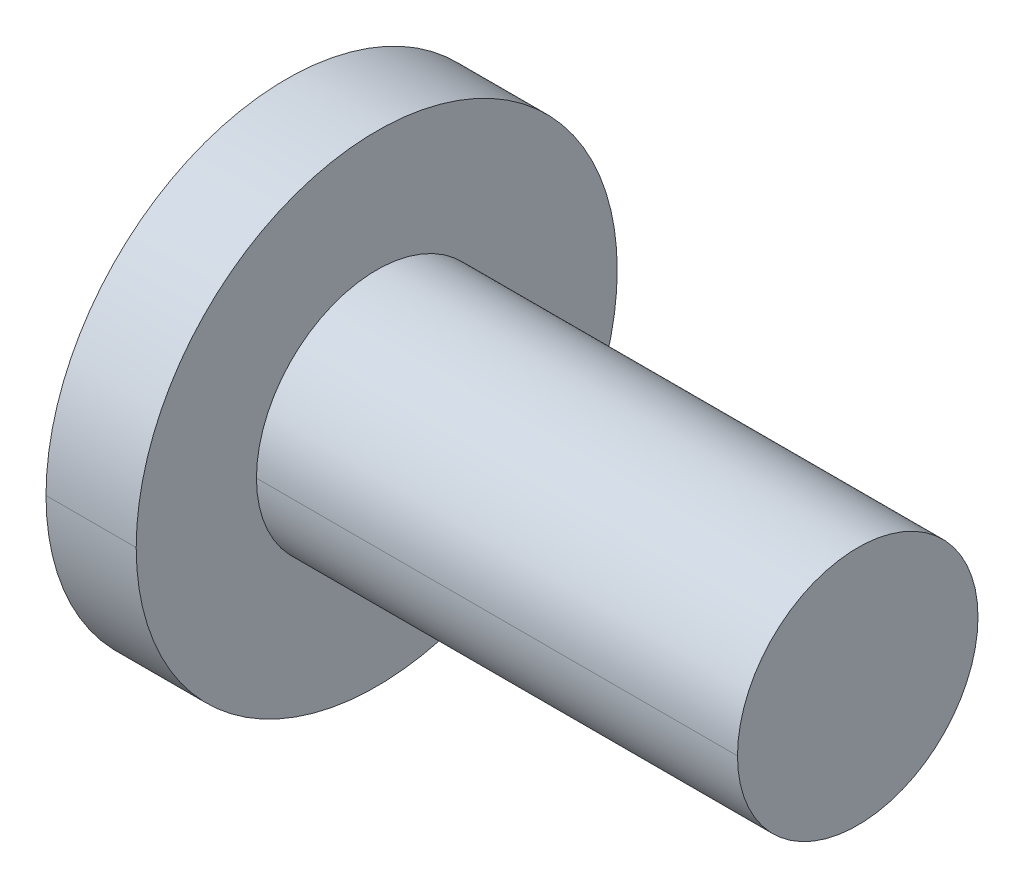
ISO-10303-21;
HEADER;
FILE_DESCRIPTION(('STEP AP214'),'2;1');
FILE_NAME('part.step','',(''),(''),'','','');
FILE_SCHEMA(('AUTOMOTIVE_DESIGN { 1 0 10303 214 1 1 1 1 }'));
ENDSEC;
DATA;
#1=APPLICATION_CONTEXT('core data for automotive mechanical design processes');
#2=APPLICATION_PROTOCOL_DEFINITION('international standard','automotive_design',2000,#1);
#3=PRODUCT_CONTEXT('',#1,'mechanical');
#4=PRODUCT('Part','Part','',(#3));
#5=PRODUCT_RELATED_PRODUCT_CATEGORY('part','',(#4));
#6=PRODUCT_DEFINITION_FORMATION('','',#4);
#7=PRODUCT_DEFINITION_CONTEXT('part definition',#1,'design');
#8=PRODUCT_DEFINITION('design','',#6,#7);
#9=PRODUCT_DEFINITION_SHAPE('','',#8);
#10=(LENGTH_UNIT() NAMED_UNIT(*) SI_UNIT(.MILLI.,.METRE.));
#11=(NAMED_UNIT(*) PLANE_ANGLE_UNIT() SI_UNIT($,.RADIAN.));
#12=(NAMED_UNIT(*) SI_UNIT($,.STERADIAN.) SOLID_ANGLE_UNIT());
#13=UNCERTAINTY_MEASURE_WITH_UNIT(LENGTH_MEASURE(1.E-05),#10,'distance_accuracy_value','');
#14=(GEOMETRIC_REPRESENTATION_CONTEXT(3) GLOBAL_UNCERTAINTY_ASSIGNED_CONTEXT((#13)) GLOBAL_UNIT_ASSIGNED_CONTEXT((#10,
#11,#12)) REPRESENTATION_CONTEXT('',''));
#15=CARTESIAN_POINT('',(0.,0.,0.));
#16=DIRECTION('',(0.,0.,1.));
#17=DIRECTION('',(1.,0.,0.));
#18=AXIS2_PLACEMENT_3D('',#15,#16,#17);
#19=CARTESIAN_POINT('',(-1.5,0.,0.));
#20=DIRECTION('',(1.,0.,0.));
#21=DIRECTION('',(0.,0.,-1.));
#22=AXIS2_PLACEMENT_3D('',#19,#20,#21);
#23=PLANE('',#22);
#24=CARTESIAN_POINT('',(-1.5,0.,0.));
#25=DIRECTION('',(1.,0.,0.));
#26=DIRECTION('',(0.,0.,-1.));
#27=AXIS2_PLACEMENT_3D('',#24,#25,#26);
#28=CIRCLE('',#27,4.);
#29=CARTESIAN_POINT('',(-1.5,0.,4.));
#30=VERTEX_POINT('',#29);
#31=CARTESIAN_POINT('',(-1.5,0.,-4.));
#32=VERTEX_POINT('',#31);
#33=EDGE_CURVE('E46',#30,#32,#28,.T.);
#34=ORIENTED_EDGE('',*,*,#33,.F.);
#35=CARTESIAN_POINT('',(-1.5,0.,0.));
#36=DIRECTION('',(1.,0.,0.));
#37=DIRECTION('',(0.,0.,-1.));
#38=AXIS2_PLACEMENT_3D('',#35,#36,#37);
#39=CIRCLE('',#38,4.);
#40=EDGE_CURVE('E320',#32,#30,#39,.T.);
#41=ORIENTED_EDGE('',*,*,#40,.F.);
#42=EDGE_LOOP('',(#34,#41));
#43=FACE_BOUND('',#42,.T.);
#44=CARTESIAN_POINT('',(-1.5,0.981495457622327,0.566666666666635));
#45=DIRECTION('',(1.,0.,0.));
#46=DIRECTION('',(0.,0.,-1.));
#47=AXIS2_PLACEMENT_3D('',#44,#45,#46);
#48=CIRCLE('',#47,0.200000000000005);
#49=CARTESIAN_POINT('',(-1.5,1.0588012008707,0.38221119219971));
#50=VERTEX_POINT('',#49);
#51=CARTESIAN_POINT('',(-1.5,0.86040520249101,0.7258431414116));
#52=VERTEX_POINT('',#51);
#53=EDGE_CURVE('E310',#50,#52,#48,.T.);
#54=ORIENTED_EDGE('',*,*,#53,.T.);
#55=CARTESIAN_POINT('',(-1.5,0.666666666666669,1.15470053837926));
#56=DIRECTION('',(1.,0.,0.));
#57=DIRECTION('',(0.,0.,-1.));
#58=AXIS2_PLACEMENT_3D('',#55,#56,#57);
#59=CIRCLE('',#58,0.470588235294121);
#60=CARTESIAN_POINT('',(-1.5,0.19839599837964,1.1080543336113));
#61=VERTEX_POINT('',#60);
#62=EDGE_CURVE('E304',#61,#52,#59,.T.);
#63=ORIENTED_EDGE('',*,*,#62,.F.);
#64=CARTESIAN_POINT('',(-1.5,0.,1.1333333333333));
#65=DIRECTION('',(1.,0.,0.));
#66=DIRECTION('',(0.,0.,-1.));
#67=AXIS2_PLACEMENT_3D('',#64,#65,#66);
#68=CIRCLE('',#67,0.2);
#69=CARTESIAN_POINT('',(-1.5,-0.19839599837964,1.1080543336113));
#70=VERTEX_POINT('',#69);
#71=EDGE_CURVE('E302',#61,#70,#68,.T.);
#72=ORIENTED_EDGE('',*,*,#71,.T.);
#73=CARTESIAN_POINT('',(-1.5,-0.666666666666669,1.15470053837926));
#74=DIRECTION('',(1.,0.,0.));
#75=DIRECTION('',(0.,0.,-1.));
#76=AXIS2_PLACEMENT_3D('',#73,#74,#75);
#77=CIRCLE('',#76,0.470588235294122);
#78=CARTESIAN_POINT('',(-1.5,-0.86040520249101,0.7258431414116));
#79=VERTEX_POINT('',#78);
#80=EDGE_CURVE('E291',#79,#70,#77,.T.);
#81=ORIENTED_EDGE('',*,*,#80,.F.);
#82=CARTESIAN_POINT('',(-1.5,-0.981495457622395,0.566666666666697));
#83=DIRECTION('',(1.,0.,0.));
#84=DIRECTION('',(0.,0.,-1.));
#85=AXIS2_PLACEMENT_3D('',#82,#83,#84);
#86=CIRCLE('',#85,0.199999999999997);
#87=CARTESIAN_POINT('',(-1.5,-1.0588012008706,0.38221119219971));
#88=VERTEX_POINT('',#87);
#89=EDGE_CURVE('E286',#79,#88,#86,.T.);
#90=ORIENTED_EDGE('',*,*,#89,.T.);
#91=CARTESIAN_POINT('',(-1.5,-1.33333333333334,0.));
#92=DIRECTION('',(1.,0.,0.));
#93=DIRECTION('',(0.,0.,-1.));
#94=AXIS2_PLACEMENT_3D('',#91,#92,#93);
#95=CIRCLE('',#94,0.470588235294124);
#96=CARTESIAN_POINT('',(-1.5,-1.0588012008707,-0.38221119219971));
#97=VERTEX_POINT('',#96);
#98=EDGE_CURVE('E283',#97,#88,#95,.T.);
#99=ORIENTED_EDGE('',*,*,#98,.F.);
#100=CARTESIAN_POINT('',(-1.5,-0.981495457622394,-0.566666666666674));
#101=DIRECTION('',(1.,0.,0.));
#102=DIRECTION('',(0.,0.,-1.));
#103=AXIS2_PLACEMENT_3D('',#100,#101,#102);
#104=CIRCLE('',#103,0.200000000000014);
#105=CARTESIAN_POINT('',(-1.5,-0.86040520249101,-0.7258431414116));
#106=VERTEX_POINT('',#105);
#107=EDGE_CURVE('E272',#97,#106,#104,.T.);
#108=ORIENTED_EDGE('',*,*,#107,.T.);
#109=CARTESIAN_POINT('',(-1.5,-0.666666666666669,-1.15470053837926));
#110=DIRECTION('',(1.,0.,0.));
#111=DIRECTION('',(0.,0.,-1.));
#112=AXIS2_PLACEMENT_3D('',#109,#110,#111);
#113=CIRCLE('',#112,0.470588235294121);
#114=CARTESIAN_POINT('',(-1.5,-0.19839599837964,-1.1080543336113));
#115=VERTEX_POINT('',#114);
#116=EDGE_CURVE('E266',#115,#106,#113,.T.);
#117=ORIENTED_EDGE('',*,*,#116,.F.);
#118=CARTESIAN_POINT('',(-1.5,0.,-1.1333333333333));
#119=DIRECTION('',(1.,0.,0.));
#120=DIRECTION('',(0.,0.,-1.));
#121=AXIS2_PLACEMENT_3D('',#118,#119,#120);
#122=CIRCLE('',#121,0.2);
#123=CARTESIAN_POINT('',(-1.5,0.19839599837964,-1.1080543336113));
#124=VERTEX_POINT('',#123);
#125=EDGE_CURVE('E264',#115,#124,#122,.T.);
#126=ORIENTED_EDGE('',*,*,#125,.T.);
#127=CARTESIAN_POINT('',(-1.5,0.666666666666664,-1.15470053837924));
#128=DIRECTION('',(1.,0.,0.));
#129=DIRECTION('',(0.,0.,-1.));
#130=AXIS2_PLACEMENT_3D('',#127,#128,#129);
#131=CIRCLE('',#130,0.470588235294114);
#132=CARTESIAN_POINT('',(-1.5,0.86040520249102,-0.7258431414116));
#133=VERTEX_POINT('',#132);
#134=EDGE_CURVE('E263',#133,#124,#131,.T.);
#135=ORIENTED_EDGE('',*,*,#134,.F.);
#136=CARTESIAN_POINT('',(-1.5,0.981495457622399,-0.566666666666696));
#137=DIRECTION('',(1.,0.,0.));
#138=DIRECTION('',(0.,0.,-1.));
#139=AXIS2_PLACEMENT_3D('',#136,#137,#138);
#140=CIRCLE('',#139,0.199999999999994);
#141=CARTESIAN_POINT('',(-1.5,1.0588012008706,-0.382211192199711));
#142=VERTEX_POINT('',#141);
#143=EDGE_CURVE('E247',#133,#142,#140,.T.);
#144=ORIENTED_EDGE('',*,*,#143,.T.);
#145=CARTESIAN_POINT('',(-1.5,1.33333333333334,0.));
#146=DIRECTION('',(-1.,0.,0.));
#147=DIRECTION('',(0.,0.,-1.));
#148=AXIS2_PLACEMENT_3D('',#145,#146,#147);
#149=CIRCLE('',#148,0.470588235294124);
#150=EDGE_CURVE('E243',#142,#50,#149,.T.);
#151=ORIENTED_EDGE('',*,*,#150,.T.);
#152=EDGE_LOOP('',(#54,#63,#72,#81,#90,#99,#108,#117,#126,#135,#144,#151));
#153=FACE_BOUND('',#152,.T.);
#154=ADVANCED_FACE('F39',(#43,#153),#23,.F.);
#155=CARTESIAN_POINT('',(0.,1.33333333333334,0.));
#156=DIRECTION('',(-1.,0.,0.));
#157=DIRECTION('',(0.,1.,-1.30500995355961E-13));
#158=AXIS2_PLACEMENT_3D('',#155,#156,#157);
#159=CYLINDRICAL_SURFACE('',#158,0.470588235294124);
#160=DIRECTION('',(-1.,0.,0.));
#161=VECTOR('',#160,1.);
#162=CARTESIAN_POINT('',(0.,1.0588012008707,0.38221119219971));
#163=LINE('',#162,#161);
#164=CARTESIAN_POINT('',(0.,1.0588012008707,0.38221119219971));
#165=VERTEX_POINT('',#164);
#166=EDGE_CURVE('E237',#165,#50,#163,.T.);
#167=ORIENTED_EDGE('',*,*,#166,.T.);
#168=ORIENTED_EDGE('',*,*,#150,.F.);
#169=DIRECTION('',(-1.,0.,0.));
#170=VECTOR('',#169,1.);
#171=CARTESIAN_POINT('',(0.,1.0588012008706,-0.382211192199711));
#172=LINE('',#171,#170);
#173=CARTESIAN_POINT('',(0.,1.0588012008706,-0.382211192199711));
#174=VERTEX_POINT('',#173);
#175=EDGE_CURVE('E233',#174,#142,#172,.T.);
#176=ORIENTED_EDGE('',*,*,#175,.F.);
#177=CARTESIAN_POINT('',(0.,1.33333333333334,0.));
#178=DIRECTION('',(1.,0.,0.));
#179=DIRECTION('',(0.,0.,-1.));
#180=AXIS2_PLACEMENT_3D('',#177,#178,#179);
#181=CIRCLE('',#180,0.470588235294124);
#182=EDGE_CURVE('E228',#165,#174,#181,.T.);
#183=ORIENTED_EDGE('',*,*,#182,.F.);
#184=EDGE_LOOP('',(#167,#168,#176,#183));
#185=FACE_BOUND('',#184,.T.);
#186=ADVANCED_FACE('F336',(#185),#159,.T.);
#187=CARTESIAN_POINT('',(0.,0.824081062144498,0.860683602522947));
#188=DIRECTION('',(1.,0.,0.));
#189=DIRECTION('',(0.,0.,-1.));
#190=AXIS2_PLACEMENT_3D('',#187,#188,#189);
#191=PLANE('',#190);
#192=CARTESIAN_POINT('',(0.,0.666666666666669,1.15470053837926));
#193=DIRECTION('',(1.,0.,0.));
#194=DIRECTION('',(0.,0.,-1.));
#195=AXIS2_PLACEMENT_3D('',#192,#193,#194);
#196=CIRCLE('',#195,0.470588235294121);
#197=CARTESIAN_POINT('',(0.,0.19839599837964,1.1080543336113));
#198=VERTEX_POINT('',#197);
#199=CARTESIAN_POINT('',(0.,0.86040520249101,0.7258431414116));
#200=VERTEX_POINT('',#199);
#201=EDGE_CURVE('E224',#198,#200,#196,.T.);
#202=ORIENTED_EDGE('',*,*,#201,.T.);
#203=CARTESIAN_POINT('',(0.,0.981495457622327,0.566666666666635));
#204=DIRECTION('',(1.,0.,0.));
#205=DIRECTION('',(0.,0.,-1.));
#206=AXIS2_PLACEMENT_3D('',#203,#204,#205);
#207=CIRCLE('',#206,0.200000000000005);
#208=EDGE_CURVE('E220',#165,#200,#207,.T.);
#209=ORIENTED_EDGE('',*,*,#208,.F.);
#210=ORIENTED_EDGE('',*,*,#182,.T.);
#211=CARTESIAN_POINT('',(0.,0.981495457622399,-0.566666666666696));
#212=DIRECTION('',(1.,0.,0.));
#213=DIRECTION('',(0.,0.,-1.));
#214=AXIS2_PLACEMENT_3D('',#211,#212,#213);
#215=CIRCLE('',#214,0.199999999999994);
#216=CARTESIAN_POINT('',(0.,0.86040520249102,-0.7258431414116));
#217=VERTEX_POINT('',#216);
#218=EDGE_CURVE('E218',#217,#174,#215,.T.);
#219=ORIENTED_EDGE('',*,*,#218,.F.);
#220=CARTESIAN_POINT('',(0.,0.666666666666664,-1.15470053837924));
#221=DIRECTION('',(1.,0.,0.));
#222=DIRECTION('',(0.,0.,-1.));
#223=AXIS2_PLACEMENT_3D('',#220,#221,#222);
#224=CIRCLE('',#223,0.470588235294114);
#225=CARTESIAN_POINT('',(0.,0.19839599837964,-1.1080543336113));
#226=VERTEX_POINT('',#225);
#227=EDGE_CURVE('E397',#217,#226,#224,.T.);
#228=ORIENTED_EDGE('',*,*,#227,.T.);
#229=CARTESIAN_POINT('',(0.,0.,-1.1333333333333));
#230=DIRECTION('',(1.,0.,0.));
#231=DIRECTION('',(0.,0.,-1.));
#232=AXIS2_PLACEMENT_3D('',#229,#230,#231);
#233=CIRCLE('',#232,0.2);
#234=CARTESIAN_POINT('',(0.,-0.19839599837964,-1.1080543336113));
#235=VERTEX_POINT('',#234);
#236=EDGE_CURVE('E392',#235,#226,#233,.T.);
#237=ORIENTED_EDGE('',*,*,#236,.F.);
#238=CARTESIAN_POINT('',(0.,-0.666666666666669,-1.15470053837926));
#239=DIRECTION('',(1.,0.,0.));
#240=DIRECTION('',(0.,0.,-1.));
#241=AXIS2_PLACEMENT_3D('',#238,#239,#240);
#242=CIRCLE('',#241,0.470588235294121);
#243=CARTESIAN_POINT('',(0.,-0.86040520249101,-0.7258431414116));
#244=VERTEX_POINT('',#243);
#245=EDGE_CURVE('E388',#235,#244,#242,.T.);
#246=ORIENTED_EDGE('',*,*,#245,.T.);
#247=CARTESIAN_POINT('',(0.,-0.981495457622394,-0.566666666666674));
#248=DIRECTION('',(1.,0.,0.));
#249=DIRECTION('',(0.,0.,-1.));
#250=AXIS2_PLACEMENT_3D('',#247,#248,#249);
#251=CIRCLE('',#250,0.200000000000014);
#252=CARTESIAN_POINT('',(0.,-1.0588012008707,-0.38221119219971));
#253=VERTEX_POINT('',#252);
#254=EDGE_CURVE('E383',#253,#244,#251,.T.);
#255=ORIENTED_EDGE('',*,*,#254,.F.);
#256=CARTESIAN_POINT('',(0.,-1.33333333333334,0.));
#257=DIRECTION('',(1.,0.,0.));
#258=DIRECTION('',(0.,0.,-1.));
#259=AXIS2_PLACEMENT_3D('',#256,#257,#258);
#260=CIRCLE('',#259,0.470588235294124);
#261=CARTESIAN_POINT('',(0.,-1.0588012008706,0.38221119219971));
#262=VERTEX_POINT('',#261);
#263=EDGE_CURVE('E379',#253,#262,#260,.T.);
#264=ORIENTED_EDGE('',*,*,#263,.T.);
#265=CARTESIAN_POINT('',(0.,-0.981495457622395,0.566666666666697));
#266=DIRECTION('',(1.,0.,0.));
#267=DIRECTION('',(0.,0.,-1.));
#268=AXIS2_PLACEMENT_3D('',#265,#266,#267);
#269=CIRCLE('',#268,0.199999999999997);
#270=CARTESIAN_POINT('',(0.,-0.86040520249101,0.7258431414116));
#271=VERTEX_POINT('',#270);
#272=EDGE_CURVE('E374',#271,#262,#269,.T.);
#273=ORIENTED_EDGE('',*,*,#272,.F.);
#274=CARTESIAN_POINT('',(0.,-0.666666666666669,1.15470053837926));
#275=DIRECTION('',(1.,0.,0.));
#276=DIRECTION('',(0.,0.,-1.));
#277=AXIS2_PLACEMENT_3D('',#274,#275,#276);
#278=CIRCLE('',#277,0.470588235294122);
#279=CARTESIAN_POINT('',(0.,-0.19839599837964,1.1080543336113));
#280=VERTEX_POINT('',#279);
#281=EDGE_CURVE('E356',#271,#280,#278,.T.);
#282=ORIENTED_EDGE('',*,*,#281,.T.);
#283=CARTESIAN_POINT('',(0.,0.,1.1333333333333));
#284=DIRECTION('',(1.,0.,0.));
#285=DIRECTION('',(0.,0.,-1.));
#286=AXIS2_PLACEMENT_3D('',#283,#284,#285);
#287=CIRCLE('',#286,0.2);
#288=EDGE_CURVE('E354',#198,#280,#287,.T.);
#289=ORIENTED_EDGE('',*,*,#288,.F.);
#290=EDGE_LOOP('',(#202,#209,#210,#219,#228,#237,#246,#255,#264,#273,#282,#289));
#291=FACE_BOUND('',#290,.T.);
#292=ADVANCED_FACE('F352',(#291),#191,.F.);
#293=CARTESIAN_POINT('',(0.,0.,1.1333333333333));
#294=DIRECTION('',(-1.,0.,0.));
#295=DIRECTION('',(0.,0.,-1.));
#296=AXIS2_PLACEMENT_3D('',#293,#294,#295);
#297=CYLINDRICAL_SURFACE('',#296,0.2);
#298=ORIENTED_EDGE('',*,*,#71,.F.);
#299=DIRECTION('',(-1.,0.,0.));
#300=VECTOR('',#299,1.);
#301=CARTESIAN_POINT('',(0.,0.19839599837964,1.1080543336113));
#302=LINE('',#301,#300);
#303=EDGE_CURVE('E347',#198,#61,#302,.T.);
#304=ORIENTED_EDGE('',*,*,#303,.F.);
#305=ORIENTED_EDGE('',*,*,#288,.T.);
#306=DIRECTION('',(-1.,0.,0.));
#307=VECTOR('',#306,1.);
#308=CARTESIAN_POINT('',(0.,-0.19839599837964,1.1080543336113));
#309=LINE('',#308,#307);
#310=EDGE_CURVE('E362',#280,#70,#309,.T.);
#311=ORIENTED_EDGE('',*,*,#310,.T.);
#312=EDGE_LOOP('',(#298,#304,#305,#311));
#313=FACE_BOUND('',#312,.T.);
#314=ADVANCED_FACE('F361',(#313),#297,.F.);
#315=CARTESIAN_POINT('',(0.,-0.666666666666669,1.15470053837926));
#316=DIRECTION('',(-1.,0.,0.));
#317=DIRECTION('',(0.,-0.500000002019299,0.866025402618596));
#318=AXIS2_PLACEMENT_3D('',#315,#316,#317);
#319=CYLINDRICAL_SURFACE('',#318,0.470588235294122);
#320=ORIENTED_EDGE('',*,*,#80,.T.);
#321=ORIENTED_EDGE('',*,*,#310,.F.);
#322=ORIENTED_EDGE('',*,*,#281,.F.);
#323=DIRECTION('',(-1.,0.,0.));
#324=VECTOR('',#323,1.);
#325=CARTESIAN_POINT('',(0.,-0.86040520249101,0.7258431414116));
#326=LINE('',#325,#324);
#327=EDGE_CURVE('E364',#271,#79,#326,.T.);
#328=ORIENTED_EDGE('',*,*,#327,.T.);
#329=EDGE_LOOP('',(#320,#321,#322,#328));
#330=FACE_BOUND('',#329,.T.);
#331=ADVANCED_FACE('F446',(#330),#319,.T.);
#332=CARTESIAN_POINT('',(0.,-0.981495457622395,0.566666666666697));
#333=DIRECTION('',(-1.,0.,0.));
#334=DIRECTION('',(0.,0.866025406325275,-0.499999995599143));
#335=AXIS2_PLACEMENT_3D('',#332,#333,#334);
#336=CYLINDRICAL_SURFACE('',#335,0.199999999999997);
#337=ORIENTED_EDGE('',*,*,#89,.F.);
#338=ORIENTED_EDGE('',*,*,#327,.F.);
#339=ORIENTED_EDGE('',*,*,#272,.T.);
#340=DIRECTION('',(-1.,0.,0.));
#341=VECTOR('',#340,1.);
#342=CARTESIAN_POINT('',(0.,-1.0588012008706,0.38221119219971));
#343=LINE('',#342,#341);
#344=EDGE_CURVE('E432',#262,#88,#343,.T.);
#345=ORIENTED_EDGE('',*,*,#344,.T.);
#346=EDGE_LOOP('',(#337,#338,#339,#345));
#347=FACE_BOUND('',#346,.T.);
#348=ADVANCED_FACE('F448',(#347),#336,.F.);
#349=CARTESIAN_POINT('',(0.,-1.33333333333334,0.));
#350=DIRECTION('',(-1.,0.,0.));
#351=DIRECTION('',(0.,-1.,1.30845504640801E-13));
#352=AXIS2_PLACEMENT_3D('',#349,#350,#351);
#353=CYLINDRICAL_SURFACE('',#352,0.470588235294124);
#354=ORIENTED_EDGE('',*,*,#98,.T.);
#355=ORIENTED_EDGE('',*,*,#344,.F.);
#356=ORIENTED_EDGE('',*,*,#263,.F.);
#357=DIRECTION('',(-1.,0.,0.));
#358=VECTOR('',#357,1.);
#359=CARTESIAN_POINT('',(0.,-1.0588012008707,-0.38221119219971));
#360=LINE('',#359,#358);
#361=EDGE_CURVE('E422',#253,#97,#360,.T.);
#362=ORIENTED_EDGE('',*,*,#361,.T.);
#363=EDGE_LOOP('',(#354,#355,#356,#362));
#364=FACE_BOUND('',#363,.T.);
#365=ADVANCED_FACE('F451',(#364),#353,.T.);
#366=CARTESIAN_POINT('',(0.,-0.981495457622394,-0.566666666666674));
#367=DIRECTION('',(-1.,0.,0.));
#368=DIRECTION('',(0.,0.866025406325166,0.499999995599331));
#369=AXIS2_PLACEMENT_3D('',#366,#367,#368);
#370=CYLINDRICAL_SURFACE('',#369,0.200000000000014);
#371=ORIENTED_EDGE('',*,*,#107,.F.);
#372=ORIENTED_EDGE('',*,*,#361,.F.);
#373=ORIENTED_EDGE('',*,*,#254,.T.);
#374=DIRECTION('',(-1.,0.,0.));
#375=VECTOR('',#374,1.);
#376=CARTESIAN_POINT('',(0.,-0.86040520249101,-0.7258431414116));
#377=LINE('',#376,#375);
#378=EDGE_CURVE('E416',#244,#106,#377,.T.);
#379=ORIENTED_EDGE('',*,*,#378,.T.);
#380=EDGE_LOOP('',(#371,#372,#373,#379));
#381=FACE_BOUND('',#380,.T.);
#382=ADVANCED_FACE('F456',(#381),#370,.F.);
#383=CARTESIAN_POINT('',(0.,-0.666666666666669,-1.15470053837926));
#384=DIRECTION('',(-1.,0.,0.));
#385=DIRECTION('',(0.,-0.500000002019298,-0.866025402618596));
#386=AXIS2_PLACEMENT_3D('',#383,#384,#385);
#387=CYLINDRICAL_SURFACE('',#386,0.470588235294121);
#388=ORIENTED_EDGE('',*,*,#116,.T.);
#389=ORIENTED_EDGE('',*,*,#378,.F.);
#390=ORIENTED_EDGE('',*,*,#245,.F.);
#391=DIRECTION('',(-1.,0.,0.));
#392=VECTOR('',#391,1.);
#393=CARTESIAN_POINT('',(0.,-0.19839599837964,-1.1080543336113));
#394=LINE('',#393,#392);
#395=EDGE_CURVE('E414',#235,#115,#394,.T.);
#396=ORIENTED_EDGE('',*,*,#395,.T.);
#397=EDGE_LOOP('',(#388,#389,#390,#396));
#398=FACE_BOUND('',#397,.T.);
#399=ADVANCED_FACE('F458',(#398),#387,.T.);
#400=CARTESIAN_POINT('',(0.,0.,-1.1333333333333));
#401=DIRECTION('',(-1.,0.,0.));
#402=DIRECTION('',(0.,0.,1.));
#403=AXIS2_PLACEMENT_3D('',#400,#401,#402);
#404=CYLINDRICAL_SURFACE('',#403,0.2);
#405=ORIENTED_EDGE('',*,*,#125,.F.);
#406=ORIENTED_EDGE('',*,*,#395,.F.);
#407=ORIENTED_EDGE('',*,*,#236,.T.);
#408=DIRECTION('',(-1.,0.,0.));
#409=VECTOR('',#408,1.);
#410=CARTESIAN_POINT('',(0.,0.19839599837964,-1.1080543336113));
#411=LINE('',#410,#409);
#412=EDGE_CURVE('E202',#226,#124,#411,.T.);
#413=ORIENTED_EDGE('',*,*,#412,.T.);
#414=EDGE_LOOP('',(#405,#406,#407,#413));
#415=FACE_BOUND('',#414,.T.);
#416=ADVANCED_FACE('F459',(#415),#404,.F.);
#417=CARTESIAN_POINT('',(0.,0.666666666666664,-1.15470053837924));
#418=DIRECTION('',(-1.,0.,0.));
#419=DIRECTION('',(0.,0.500000002019295,-0.866025402618598));
#420=AXIS2_PLACEMENT_3D('',#417,#418,#419);
#421=CYLINDRICAL_SURFACE('',#420,0.470588235294114);
#422=ORIENTED_EDGE('',*,*,#134,.T.);
#423=ORIENTED_EDGE('',*,*,#412,.F.);
#424=ORIENTED_EDGE('',*,*,#227,.F.);
#425=DIRECTION('',(-1.,0.,0.));
#426=VECTOR('',#425,1.);
#427=CARTESIAN_POINT('',(0.,0.86040520249102,-0.7258431414116));
#428=LINE('',#427,#426);
#429=EDGE_CURVE('E197',#217,#133,#428,.T.);
#430=ORIENTED_EDGE('',*,*,#429,.T.);
#431=EDGE_LOOP('',(#422,#423,#424,#430));
#432=FACE_BOUND('',#431,.T.);
#433=ADVANCED_FACE('F410',(#432),#421,.T.);
#434=CARTESIAN_POINT('',(0.,0.981495457622399,-0.566666666666696));
#435=DIRECTION('',(-1.,0.,0.));
#436=DIRECTION('',(0.,-0.866025406325286,0.499999995599123));
#437=AXIS2_PLACEMENT_3D('',#434,#435,#436);
#438=CYLINDRICAL_SURFACE('',#437,0.199999999999994);
#439=ORIENTED_EDGE('',*,*,#143,.F.);
#440=ORIENTED_EDGE('',*,*,#429,.F.);
#441=ORIENTED_EDGE('',*,*,#218,.T.);
#442=ORIENTED_EDGE('',*,*,#175,.T.);
#443=EDGE_LOOP('',(#439,#440,#441,#442));
#444=FACE_BOUND('',#443,.T.);
#445=ADVANCED_FACE('F406',(#444),#438,.F.);
#446=CARTESIAN_POINT('',(0.,0.666666666666669,1.15470053837926));
#447=DIRECTION('',(-1.,0.,0.));
#448=DIRECTION('',(0.,0.500000002019299,0.866025402618596));
#449=AXIS2_PLACEMENT_3D('',#446,#447,#448);
#450=CYLINDRICAL_SURFACE('',#449,0.470588235294121);
#451=ORIENTED_EDGE('',*,*,#62,.T.);
#452=DIRECTION('',(-1.,0.,0.));
#453=VECTOR('',#452,1.);
#454=CARTESIAN_POINT('',(0.,0.86040520249101,0.7258431414116));
#455=LINE('',#454,#453);
#456=EDGE_CURVE('E192',#200,#52,#455,.T.);
#457=ORIENTED_EDGE('',*,*,#456,.F.);
#458=ORIENTED_EDGE('',*,*,#201,.F.);
#459=ORIENTED_EDGE('',*,*,#303,.T.);
#460=EDGE_LOOP('',(#451,#457,#458,#459));
#461=FACE_BOUND('',#460,.T.);
#462=ADVANCED_FACE('F344',(#461),#450,.T.);
#463=CARTESIAN_POINT('',(0.,0.981495457622327,0.566666666666635));
#464=DIRECTION('',(-1.,0.,0.));
#465=DIRECTION('',(0.,-0.866025406325166,-0.499999995599331));
#466=AXIS2_PLACEMENT_3D('',#463,#464,#465);
#467=CYLINDRICAL_SURFACE('',#466,0.200000000000005);
#468=ORIENTED_EDGE('',*,*,#53,.F.);
#469=ORIENTED_EDGE('',*,*,#166,.F.);
#470=ORIENTED_EDGE('',*,*,#208,.T.);
#471=ORIENTED_EDGE('',*,*,#456,.T.);
#472=EDGE_LOOP('',(#468,#469,#470,#471));
#473=FACE_BOUND('',#472,.T.);
#474=ADVANCED_FACE('F349',(#473),#467,.F.);
#475=CARTESIAN_POINT('',(12.,0.,0.));
#476=DIRECTION('',(1.,0.,0.));
#477=DIRECTION('',(0.,-1.,0.));
#478=AXIS2_PLACEMENT_3D('',#475,#476,#477);
#479=CYLINDRICAL_SURFACE('',#478,4.);
#480=DIRECTION('',(1.,0.,0.));
#481=VECTOR('',#480,1.);
#482=CARTESIAN_POINT('',(-1.5,0.,4.));
#483=LINE('',#482,#481);
#484=CARTESIAN_POINT('',(0.,0.,4.));
#485=VERTEX_POINT('',#484);
#486=EDGE_CURVE('E188',#30,#485,#483,.T.);
#487=ORIENTED_EDGE('',*,*,#486,.T.);
#488=CARTESIAN_POINT('',(0.,0.,0.));
#489=DIRECTION('',(1.,0.,0.));
#490=DIRECTION('',(0.,0.,-1.));
#491=AXIS2_PLACEMENT_3D('',#488,#489,#490);
#492=CIRCLE('',#491,4.);
#493=CARTESIAN_POINT('',(0.,0.,-4.));
#494=VERTEX_POINT('',#493);
#495=EDGE_CURVE('E183',#494,#485,#492,.T.);
#496=ORIENTED_EDGE('',*,*,#495,.F.);
#497=DIRECTION('',(1.,0.,0.));
#498=VECTOR('',#497,1.);
#499=CARTESIAN_POINT('',(-1.5,0.,-4.));
#500=LINE('',#499,#498);
#501=EDGE_CURVE('E178',#32,#494,#500,.T.);
#502=ORIENTED_EDGE('',*,*,#501,.F.);
#503=ORIENTED_EDGE('',*,*,#40,.T.);
#504=EDGE_LOOP('',(#487,#496,#502,#503));
#505=FACE_BOUND('',#504,.T.);
#506=ADVANCED_FACE('F333',(#505),#479,.T.);
#507=CARTESIAN_POINT('',(12.,0.,0.));
#508=DIRECTION('',(1.,0.,0.));
#509=DIRECTION('',(0.,1.,0.));
#510=AXIS2_PLACEMENT_3D('',#507,#508,#509);
#511=CYLINDRICAL_SURFACE('',#510,4.);
#512=ORIENTED_EDGE('',*,*,#486,.F.);
#513=ORIENTED_EDGE('',*,*,#33,.T.);
#514=ORIENTED_EDGE('',*,*,#501,.T.);
#515=CARTESIAN_POINT('',(0.,0.,0.));
#516=DIRECTION('',(1.,0.,0.));
#517=DIRECTION('',(0.,0.,-1.));
#518=AXIS2_PLACEMENT_3D('',#515,#516,#517);
#519=CIRCLE('',#518,4.);
#520=EDGE_CURVE('E173',#485,#494,#519,.T.);
#521=ORIENTED_EDGE('',*,*,#520,.F.);
#522=EDGE_LOOP('',(#512,#513,#514,#521));
#523=FACE_BOUND('',#522,.T.);
#524=ADVANCED_FACE('F329',(#523),#511,.T.);
#525=CARTESIAN_POINT('',(0.,4.,0.));
#526=DIRECTION('',(-1.,0.,0.));
#527=DIRECTION('',(0.,0.,1.));
#528=AXIS2_PLACEMENT_3D('',#525,#526,#527);
#529=PLANE('',#528);
#530=CARTESIAN_POINT('',(0.,0.,0.));
#531=DIRECTION('',(1.,0.,0.));
#532=DIRECTION('',(0.,0.,-1.));
#533=AXIS2_PLACEMENT_3D('',#530,#531,#532);
#534=CIRCLE('',#533,2.);
#535=CARTESIAN_POINT('',(0.,0.,2.));
#536=VERTEX_POINT('',#535);
#537=CARTESIAN_POINT('',(0.,0.,-2.));
#538=VERTEX_POINT('',#537);
#539=EDGE_CURVE('E160',#536,#538,#534,.T.);
#540=ORIENTED_EDGE('',*,*,#539,.F.);
#541=CARTESIAN_POINT('',(0.,0.,0.));
#542=DIRECTION('',(1.,0.,0.));
#543=DIRECTION('',(0.,0.,-1.));
#544=AXIS2_PLACEMENT_3D('',#541,#542,#543);
#545=CIRCLE('',#544,2.);
#546=EDGE_CURVE('E162',#538,#536,#545,.T.);
#547=ORIENTED_EDGE('',*,*,#546,.F.);
#548=EDGE_LOOP('',(#540,#547));
#549=FACE_BOUND('',#548,.T.);
#550=ORIENTED_EDGE('',*,*,#495,.T.);
#551=ORIENTED_EDGE('',*,*,#520,.T.);
#552=EDGE_LOOP('',(#550,#551));
#553=FACE_BOUND('',#552,.T.);
#554=ADVANCED_FACE('F493',(#549,#553),#529,.F.);
#555=CARTESIAN_POINT('',(12.,0.,0.));
#556=DIRECTION('',(1.,0.,0.));
#557=DIRECTION('',(0.,-1.,0.));
#558=AXIS2_PLACEMENT_3D('',#555,#556,#557);
#559=CYLINDRICAL_SURFACE('',#558,2.);
#560=CARTESIAN_POINT('',(8.,0.,0.));
#561=DIRECTION('',(-1.,0.,0.));
#562=DIRECTION('',(0.,-1.,0.));
#563=AXIS2_PLACEMENT_3D('',#560,#561,#562);
#564=CIRCLE('',#563,2.);
#565=CARTESIAN_POINT('',(8.,0.,-2.));
#566=VERTEX_POINT('',#565);
#567=CARTESIAN_POINT('',(8.,0.,2.));
#568=VERTEX_POINT('',#567);
#569=EDGE_CURVE('E51',#566,#568,#564,.F.);
#570=ORIENTED_EDGE('',*,*,#569,.F.);
#571=DIRECTION('',(1.,0.,0.));
#572=VECTOR('',#571,1.);
#573=CARTESIAN_POINT('',(0.,0.,-2.));
#574=LINE('',#573,#572);
#575=EDGE_CURVE('E155',#538,#566,#574,.T.);
#576=ORIENTED_EDGE('',*,*,#575,.F.);
#577=ORIENTED_EDGE('',*,*,#546,.T.);
#578=DIRECTION('',(1.,0.,0.));
#579=VECTOR('',#578,1.);
#580=CARTESIAN_POINT('',(0.,0.,2.));
#581=LINE('',#580,#579);
#582=EDGE_CURVE('E157',#536,#568,#581,.T.);
#583=ORIENTED_EDGE('',*,*,#582,.T.);
#584=EDGE_LOOP('',(#570,#576,#577,#583));
#585=FACE_BOUND('',#584,.T.);
#586=ADVANCED_FACE('F153',(#585),#559,.T.);
#587=CARTESIAN_POINT('',(12.,0.,0.));
#588=DIRECTION('',(1.,0.,0.));
#589=DIRECTION('',(0.,1.,0.));
#590=AXIS2_PLACEMENT_3D('',#587,#588,#589);
#591=CYLINDRICAL_SURFACE('',#590,2.);
#592=CARTESIAN_POINT('',(8.,0.,0.));
#593=DIRECTION('',(-1.,0.,0.));
#594=DIRECTION('',(0.,-1.,0.));
#595=AXIS2_PLACEMENT_3D('',#592,#593,#594);
#596=CIRCLE('',#595,2.);
#597=EDGE_CURVE('E12',#568,#566,#596,.F.);
#598=ORIENTED_EDGE('',*,*,#597,.F.);
#599=ORIENTED_EDGE('',*,*,#582,.F.);
#600=ORIENTED_EDGE('',*,*,#539,.T.);
#601=ORIENTED_EDGE('',*,*,#575,.T.);
#602=EDGE_LOOP('',(#598,#599,#600,#601));
#603=FACE_BOUND('',#602,.T.);
#604=ADVANCED_FACE('F159',(#603),#591,.T.);
#605=CARTESIAN_POINT('',(8.,3.96695977961432,-4.00003));
#606=DIRECTION('',(-1.,0.,0.));
#607=DIRECTION('',(0.,-1.,0.));
#608=AXIS2_PLACEMENT_3D('',#605,#606,#607);
#609=PLANE('',#608);
#610=ORIENTED_EDGE('',*,*,#569,.T.);
#611=ORIENTED_EDGE('',*,*,#597,.T.);
#612=EDGE_LOOP('',(#610,#611));
#613=FACE_BOUND('',#612,.T.);
#614=ADVANCED_FACE('F146',(#613),#609,.F.);
#615=CLOSED_SHELL('',(#154,#186,#292,#314,#331,#348,#365,#382,#399,#416,#433,#445,#462,#474,
#506,#524,#554,#586,#604,#614));
#616=MANIFOLD_SOLID_BREP('B2',#615);
#617=ADVANCED_BREP_SHAPE_REPRESENTATION('',(#18,#616),#14);
#618=SHAPE_DEFINITION_REPRESENTATION(#9,#617);
ENDSEC;
END-ISO-10303-21;
